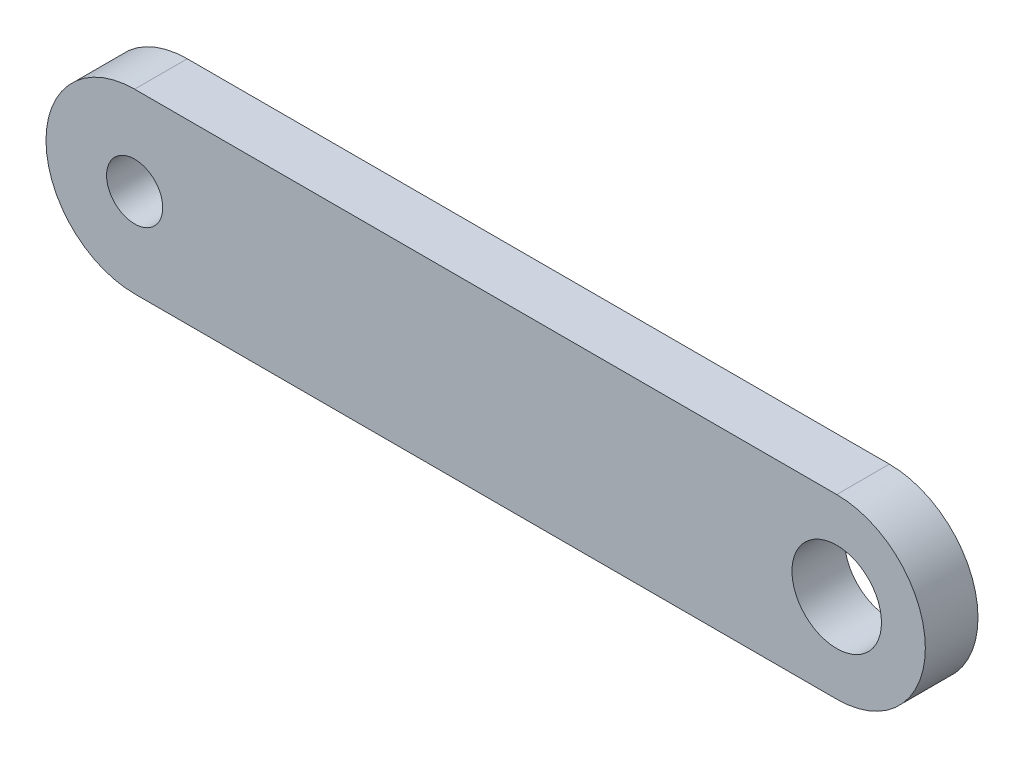
ISO-10303-21;
HEADER;
FILE_DESCRIPTION(('STEP AP214'),'2;1');
FILE_NAME('part.step','',(''),(''),'','','');
FILE_SCHEMA(('AUTOMOTIVE_DESIGN { 1 0 10303 214 1 1 1 1 }'));
ENDSEC;
DATA;
#1=APPLICATION_CONTEXT('core data for automotive mechanical design processes');
#2=APPLICATION_PROTOCOL_DEFINITION('international standard','automotive_design',2000,#1);
#3=PRODUCT_CONTEXT('',#1,'mechanical');
#4=PRODUCT('Part','Part','',(#3));
#5=PRODUCT_RELATED_PRODUCT_CATEGORY('part','',(#4));
#6=PRODUCT_DEFINITION_FORMATION('','',#4);
#7=PRODUCT_DEFINITION_CONTEXT('part definition',#1,'design');
#8=PRODUCT_DEFINITION('design','',#6,#7);
#9=PRODUCT_DEFINITION_SHAPE('','',#8);
#10=(LENGTH_UNIT() NAMED_UNIT(*) SI_UNIT(.MILLI.,.METRE.));
#11=(NAMED_UNIT(*) PLANE_ANGLE_UNIT() SI_UNIT($,.RADIAN.));
#12=(NAMED_UNIT(*) SI_UNIT($,.STERADIAN.) SOLID_ANGLE_UNIT());
#13=UNCERTAINTY_MEASURE_WITH_UNIT(LENGTH_MEASURE(1.E-05),#10,'distance_accuracy_value','');
#14=(GEOMETRIC_REPRESENTATION_CONTEXT(3) GLOBAL_UNCERTAINTY_ASSIGNED_CONTEXT((#13)) GLOBAL_UNIT_ASSIGNED_CONTEXT((#10,
#11,#12)) REPRESENTATION_CONTEXT('',''));
#15=CARTESIAN_POINT('',(0.,0.,0.));
#16=DIRECTION('',(0.,0.,1.));
#17=DIRECTION('',(1.,0.,0.));
#18=AXIS2_PLACEMENT_3D('',#15,#16,#17);
#19=CARTESIAN_POINT('',(-20.,0.,3.));
#20=DIRECTION('',(0.,0.,1.));
#21=DIRECTION('',(1.,0.,0.));
#22=AXIS2_PLACEMENT_3D('',#19,#20,#21);
#23=PLANE('',#22);
#24=CARTESIAN_POINT('',(-20.,0.,3.));
#25=DIRECTION('',(0.,0.,1.));
#26=DIRECTION('',(1.,0.,0.));
#27=AXIS2_PLACEMENT_3D('',#24,#25,#26);
#28=CIRCLE('',#27,1.6);
#29=CARTESIAN_POINT('',(-18.4,0.,3.));
#30=VERTEX_POINT('',#29);
#31=EDGE_CURVE('E113',#30,#30,#28,.T.);
#32=ORIENTED_EDGE('',*,*,#31,.F.);
#33=EDGE_LOOP('',(#32));
#34=FACE_BOUND('',#33,.T.);
#35=CARTESIAN_POINT('',(-20.,0.,3.));
#36=DIRECTION('',(0.,0.,1.));
#37=DIRECTION('',(1.,0.,0.));
#38=AXIS2_PLACEMENT_3D('',#35,#36,#37);
#39=CIRCLE('',#38,5.05);
#40=CARTESIAN_POINT('',(-20.,5.05,3.));
#41=VERTEX_POINT('',#40);
#42=CARTESIAN_POINT('',(-20.,-5.05,3.));
#43=VERTEX_POINT('',#42);
#44=EDGE_CURVE('E91',#41,#43,#39,.T.);
#45=ORIENTED_EDGE('',*,*,#44,.T.);
#46=DIRECTION('',(1.,0.,0.));
#47=VECTOR('',#46,1.);
#48=CARTESIAN_POINT('',(-20.,-5.05,3.));
#49=LINE('',#48,#47);
#50=CARTESIAN_POINT('',(20.,-5.05,3.));
#51=VERTEX_POINT('',#50);
#52=EDGE_CURVE('E86',#43,#51,#49,.T.);
#53=ORIENTED_EDGE('',*,*,#52,.T.);
#54=CARTESIAN_POINT('',(20.,0.,3.));
#55=DIRECTION('',(0.,0.,1.));
#56=DIRECTION('',(1.,0.,0.));
#57=AXIS2_PLACEMENT_3D('',#54,#55,#56);
#58=CIRCLE('',#57,5.05);
#59=CARTESIAN_POINT('',(20.,5.05,3.));
#60=VERTEX_POINT('',#59);
#61=EDGE_CURVE('E89',#51,#60,#58,.T.);
#62=ORIENTED_EDGE('',*,*,#61,.T.);
#63=DIRECTION('',(-1.,0.,0.));
#64=VECTOR('',#63,1.);
#65=CARTESIAN_POINT('',(-20.,5.05,3.));
#66=LINE('',#65,#64);
#67=EDGE_CURVE('E56',#60,#41,#66,.T.);
#68=ORIENTED_EDGE('',*,*,#67,.T.);
#69=EDGE_LOOP('',(#45,#53,#62,#68));
#70=FACE_BOUND('',#69,.T.);
#71=CARTESIAN_POINT('',(20.,0.,3.));
#72=DIRECTION('',(0.,0.,1.));
#73=DIRECTION('',(1.,0.,0.));
#74=AXIS2_PLACEMENT_3D('',#71,#72,#73);
#75=CIRCLE('',#74,2.55);
#76=CARTESIAN_POINT('',(22.55,0.,3.));
#77=VERTEX_POINT('',#76);
#78=EDGE_CURVE('E134',#77,#77,#75,.T.);
#79=ORIENTED_EDGE('',*,*,#78,.F.);
#80=EDGE_LOOP('',(#79));
#81=FACE_BOUND('',#80,.T.);
#82=ADVANCED_FACE('F38',(#34,#70,#81),#23,.T.);
#83=CARTESIAN_POINT('',(-20.,0.,0.));
#84=DIRECTION('',(0.,0.,1.));
#85=DIRECTION('',(1.,0.,0.));
#86=AXIS2_PLACEMENT_3D('',#83,#84,#85);
#87=PLANE('',#86);
#88=CARTESIAN_POINT('',(-20.,0.,0.));
#89=DIRECTION('',(0.,0.,1.));
#90=DIRECTION('',(1.,0.,0.));
#91=AXIS2_PLACEMENT_3D('',#88,#89,#90);
#92=CIRCLE('',#91,1.6);
#93=CARTESIAN_POINT('',(-18.4,0.,0.));
#94=VERTEX_POINT('',#93);
#95=EDGE_CURVE('E130',#94,#94,#92,.T.);
#96=ORIENTED_EDGE('',*,*,#95,.T.);
#97=EDGE_LOOP('',(#96));
#98=FACE_BOUND('',#97,.T.);
#99=CARTESIAN_POINT('',(-20.,0.,0.));
#100=DIRECTION('',(0.,0.,1.));
#101=DIRECTION('',(1.,0.,0.));
#102=AXIS2_PLACEMENT_3D('',#99,#100,#101);
#103=CIRCLE('',#102,5.05);
#104=CARTESIAN_POINT('',(-20.,5.05,0.));
#105=VERTEX_POINT('',#104);
#106=CARTESIAN_POINT('',(-20.,-5.05,0.));
#107=VERTEX_POINT('',#106);
#108=EDGE_CURVE('E109',#105,#107,#103,.T.);
#109=ORIENTED_EDGE('',*,*,#108,.F.);
#110=DIRECTION('',(-1.,0.,0.));
#111=VECTOR('',#110,1.);
#112=CARTESIAN_POINT('',(-20.,5.05,0.));
#113=LINE('',#112,#111);
#114=CARTESIAN_POINT('',(20.,5.05,0.));
#115=VERTEX_POINT('',#114);
#116=EDGE_CURVE('E79',#115,#105,#113,.T.);
#117=ORIENTED_EDGE('',*,*,#116,.F.);
#118=CARTESIAN_POINT('',(20.,0.,0.));
#119=DIRECTION('',(0.,0.,1.));
#120=DIRECTION('',(1.,0.,0.));
#121=AXIS2_PLACEMENT_3D('',#118,#119,#120);
#122=CIRCLE('',#121,5.05);
#123=CARTESIAN_POINT('',(20.,-5.05,0.));
#124=VERTEX_POINT('',#123);
#125=EDGE_CURVE('E73',#124,#115,#122,.T.);
#126=ORIENTED_EDGE('',*,*,#125,.F.);
#127=DIRECTION('',(1.,0.,0.));
#128=VECTOR('',#127,1.);
#129=CARTESIAN_POINT('',(-20.,-5.05,0.));
#130=LINE('',#129,#128);
#131=EDGE_CURVE('E96',#107,#124,#130,.T.);
#132=ORIENTED_EDGE('',*,*,#131,.F.);
#133=EDGE_LOOP('',(#109,#117,#126,#132));
#134=FACE_BOUND('',#133,.T.);
#135=CARTESIAN_POINT('',(20.,0.,0.));
#136=DIRECTION('',(0.,0.,1.));
#137=DIRECTION('',(1.,0.,0.));
#138=AXIS2_PLACEMENT_3D('',#135,#136,#137);
#139=CIRCLE('',#138,2.55);
#140=CARTESIAN_POINT('',(22.55,0.,0.));
#141=VERTEX_POINT('',#140);
#142=EDGE_CURVE('E138',#141,#141,#139,.T.);
#143=ORIENTED_EDGE('',*,*,#142,.T.);
#144=EDGE_LOOP('',(#143));
#145=FACE_BOUND('',#144,.T.);
#146=ADVANCED_FACE('F125',(#98,#134,#145),#87,.F.);
#147=CARTESIAN_POINT('',(-20.,0.,3.));
#148=DIRECTION('',(0.,0.,-1.));
#149=DIRECTION('',(-1.,0.,0.));
#150=AXIS2_PLACEMENT_3D('',#147,#148,#149);
#151=CYLINDRICAL_SURFACE('',#150,5.05);
#152=ORIENTED_EDGE('',*,*,#108,.T.);
#153=DIRECTION('',(0.,0.,-1.));
#154=VECTOR('',#153,1.);
#155=CARTESIAN_POINT('',(-20.,-5.05,3.));
#156=LINE('',#155,#154);
#157=EDGE_CURVE('E11',#43,#107,#156,.T.);
#158=ORIENTED_EDGE('',*,*,#157,.F.);
#159=ORIENTED_EDGE('',*,*,#44,.F.);
#160=DIRECTION('',(0.,0.,-1.));
#161=VECTOR('',#160,1.);
#162=CARTESIAN_POINT('',(-20.,5.05,3.));
#163=LINE('',#162,#161);
#164=EDGE_CURVE('E105',#41,#105,#163,.T.);
#165=ORIENTED_EDGE('',*,*,#164,.T.);
#166=EDGE_LOOP('',(#152,#158,#159,#165));
#167=FACE_BOUND('',#166,.T.);
#168=ADVANCED_FACE('F40',(#167),#151,.T.);
#169=CARTESIAN_POINT('',(-20.,-5.05,3.));
#170=DIRECTION('',(0.,1.,0.));
#171=DIRECTION('',(0.,0.,1.));
#172=AXIS2_PLACEMENT_3D('',#169,#170,#171);
#173=PLANE('',#172);
#174=ORIENTED_EDGE('',*,*,#131,.T.);
#175=DIRECTION('',(0.,0.,-1.));
#176=VECTOR('',#175,1.);
#177=CARTESIAN_POINT('',(20.,-5.05,3.));
#178=LINE('',#177,#176);
#179=EDGE_CURVE('E48',#51,#124,#178,.T.);
#180=ORIENTED_EDGE('',*,*,#179,.F.);
#181=ORIENTED_EDGE('',*,*,#52,.F.);
#182=ORIENTED_EDGE('',*,*,#157,.T.);
#183=EDGE_LOOP('',(#174,#180,#181,#182));
#184=FACE_BOUND('',#183,.T.);
#185=ADVANCED_FACE('F95',(#184),#173,.F.);
#186=CARTESIAN_POINT('',(20.,0.,3.));
#187=DIRECTION('',(0.,0.,-1.));
#188=DIRECTION('',(-1.,0.,0.));
#189=AXIS2_PLACEMENT_3D('',#186,#187,#188);
#190=CYLINDRICAL_SURFACE('',#189,5.05);
#191=ORIENTED_EDGE('',*,*,#125,.T.);
#192=DIRECTION('',(0.,0.,-1.));
#193=VECTOR('',#192,1.);
#194=CARTESIAN_POINT('',(20.,5.05,3.));
#195=LINE('',#194,#193);
#196=EDGE_CURVE('E98',#60,#115,#195,.T.);
#197=ORIENTED_EDGE('',*,*,#196,.F.);
#198=ORIENTED_EDGE('',*,*,#61,.F.);
#199=ORIENTED_EDGE('',*,*,#179,.T.);
#200=EDGE_LOOP('',(#191,#197,#198,#199));
#201=FACE_BOUND('',#200,.T.);
#202=ADVANCED_FACE('F99',(#201),#190,.T.);
#203=CARTESIAN_POINT('',(-20.,5.05,3.));
#204=DIRECTION('',(0.,-1.,0.));
#205=DIRECTION('',(0.,0.,-1.));
#206=AXIS2_PLACEMENT_3D('',#203,#204,#205);
#207=PLANE('',#206);
#208=ORIENTED_EDGE('',*,*,#116,.T.);
#209=ORIENTED_EDGE('',*,*,#164,.F.);
#210=ORIENTED_EDGE('',*,*,#67,.F.);
#211=ORIENTED_EDGE('',*,*,#196,.T.);
#212=EDGE_LOOP('',(#208,#209,#210,#211));
#213=FACE_BOUND('',#212,.T.);
#214=ADVANCED_FACE('F122',(#213),#207,.F.);
#215=CARTESIAN_POINT('',(-20.,0.,3.));
#216=DIRECTION('',(0.,0.,-1.));
#217=DIRECTION('',(-1.,0.,0.));
#218=AXIS2_PLACEMENT_3D('',#215,#216,#217);
#219=CYLINDRICAL_SURFACE('',#218,1.6);
#220=ORIENTED_EDGE('',*,*,#31,.T.);
#221=EDGE_LOOP('',(#220));
#222=FACE_BOUND('',#221,.T.);
#223=ORIENTED_EDGE('',*,*,#95,.F.);
#224=EDGE_LOOP('',(#223));
#225=FACE_BOUND('',#224,.T.);
#226=ADVANCED_FACE('F157',(#222,#225),#219,.F.);
#227=CARTESIAN_POINT('',(20.,0.,3.));
#228=DIRECTION('',(0.,0.,-1.));
#229=DIRECTION('',(-1.,0.,0.));
#230=AXIS2_PLACEMENT_3D('',#227,#228,#229);
#231=CYLINDRICAL_SURFACE('',#230,2.55);
#232=ORIENTED_EDGE('',*,*,#78,.T.);
#233=EDGE_LOOP('',(#232));
#234=FACE_BOUND('',#233,.T.);
#235=ORIENTED_EDGE('',*,*,#142,.F.);
#236=EDGE_LOOP('',(#235));
#237=FACE_BOUND('',#236,.T.);
#238=ADVANCED_FACE('F145',(#234,#237),#231,.F.);
#239=CLOSED_SHELL('',(#82,#146,#168,#185,#202,#214,#226,#238));
#240=MANIFOLD_SOLID_BREP('B2',#239);
#241=ADVANCED_BREP_SHAPE_REPRESENTATION('',(#18,#240),#14);
#242=SHAPE_DEFINITION_REPRESENTATION(#9,#241);
ENDSEC;
END-ISO-10303-21;
